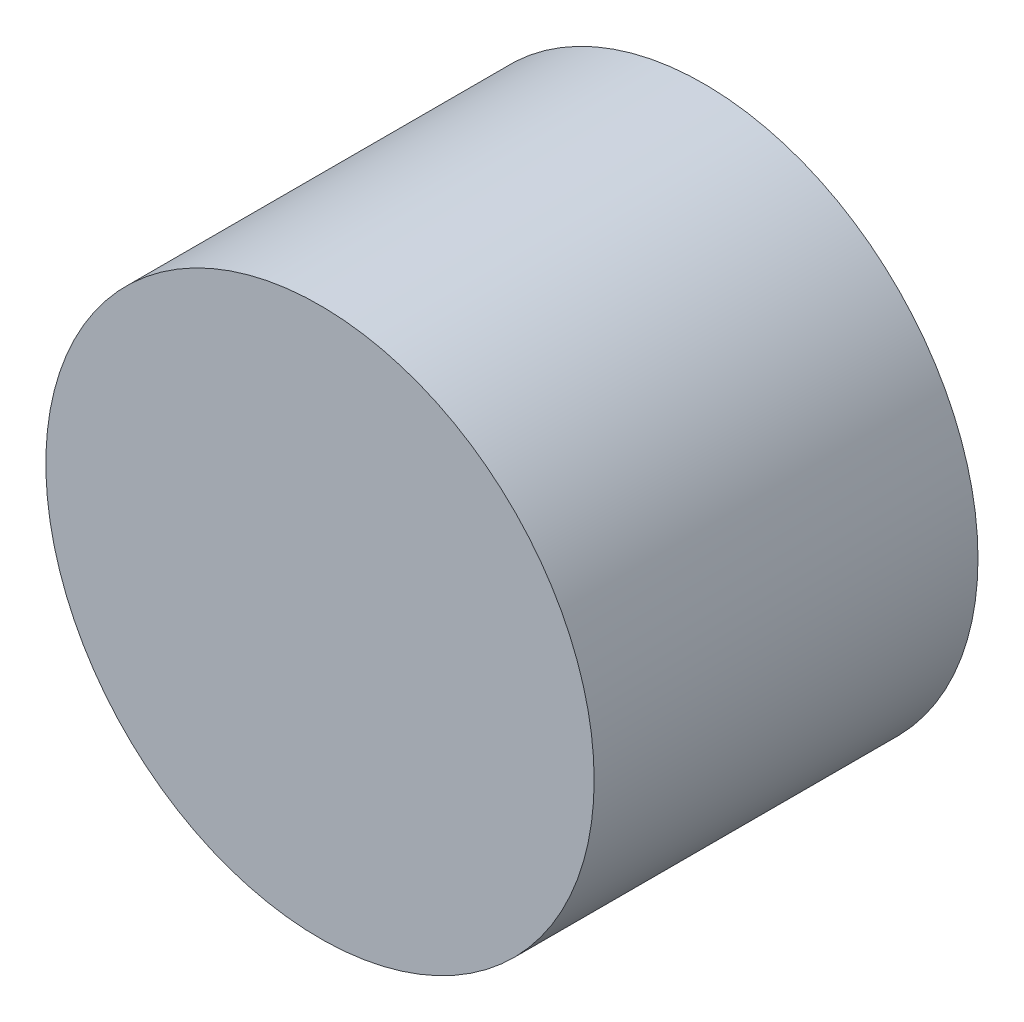
ISO-10303-21;
HEADER;
FILE_DESCRIPTION(('STEP AP214'),'2;1');
FILE_NAME('part.step','',(''),(''),'','','');
FILE_SCHEMA(('AUTOMOTIVE_DESIGN { 1 0 10303 214 1 1 1 1 }'));
ENDSEC;
DATA;
#1=APPLICATION_CONTEXT('core data for automotive mechanical design processes');
#2=APPLICATION_PROTOCOL_DEFINITION('international standard','automotive_design',2000,#1);
#3=PRODUCT_CONTEXT('',#1,'mechanical');
#4=PRODUCT('Part','Part','',(#3));
#5=PRODUCT_RELATED_PRODUCT_CATEGORY('part','',(#4));
#6=PRODUCT_DEFINITION_FORMATION('','',#4);
#7=PRODUCT_DEFINITION_CONTEXT('part definition',#1,'design');
#8=PRODUCT_DEFINITION('design','',#6,#7);
#9=PRODUCT_DEFINITION_SHAPE('','',#8);
#10=(LENGTH_UNIT() NAMED_UNIT(*) SI_UNIT(.MILLI.,.METRE.));
#11=(NAMED_UNIT(*) PLANE_ANGLE_UNIT() SI_UNIT($,.RADIAN.));
#12=(NAMED_UNIT(*) SI_UNIT($,.STERADIAN.) SOLID_ANGLE_UNIT());
#13=UNCERTAINTY_MEASURE_WITH_UNIT(LENGTH_MEASURE(1.E-05),#10,'distance_accuracy_value','');
#14=(GEOMETRIC_REPRESENTATION_CONTEXT(3) GLOBAL_UNCERTAINTY_ASSIGNED_CONTEXT((#13)) GLOBAL_UNIT_ASSIGNED_CONTEXT((#10,
#11,#12)) REPRESENTATION_CONTEXT('',''));
#15=CARTESIAN_POINT('',(0.,0.,0.));
#16=DIRECTION('',(0.,0.,1.));
#17=DIRECTION('',(1.,0.,0.));
#18=AXIS2_PLACEMENT_3D('',#15,#16,#17);
#19=CARTESIAN_POINT('',(0.,0.,44.45));
#20=DIRECTION('',(0.,0.,-1.));
#21=DIRECTION('',(-1.,0.,0.));
#22=AXIS2_PLACEMENT_3D('',#19,#20,#21);
#23=CYLINDRICAL_SURFACE('',#22,63.5);
#24=CARTESIAN_POINT('',(0.,0.,44.45));
#25=DIRECTION('',(0.,0.,1.));
#26=DIRECTION('',(1.,0.,0.));
#27=AXIS2_PLACEMENT_3D('',#24,#25,#26);
#28=CIRCLE('',#27,63.5);
#29=CARTESIAN_POINT('',(63.5,0.,44.45));
#30=VERTEX_POINT('',#29);
#31=EDGE_CURVE('E10',#30,#30,#28,.T.);
#32=ORIENTED_EDGE('',*,*,#31,.F.);
#33=EDGE_LOOP('',(#32));
#34=FACE_BOUND('',#33,.T.);
#35=CARTESIAN_POINT('',(0.,0.,-44.45));
#36=DIRECTION('',(0.,0.,1.));
#37=DIRECTION('',(1.,0.,0.));
#38=AXIS2_PLACEMENT_3D('',#35,#36,#37);
#39=CIRCLE('',#38,63.5);
#40=CARTESIAN_POINT('',(63.5,0.,-44.45));
#41=VERTEX_POINT('',#40);
#42=EDGE_CURVE('E40',#41,#41,#39,.T.);
#43=ORIENTED_EDGE('',*,*,#42,.T.);
#44=EDGE_LOOP('',(#43));
#45=FACE_BOUND('',#44,.T.);
#46=ADVANCED_FACE('F37',(#34,#45),#23,.T.);
#47=CARTESIAN_POINT('',(0.,0.,44.45));
#48=DIRECTION('',(0.,0.,1.));
#49=DIRECTION('',(1.,0.,0.));
#50=AXIS2_PLACEMENT_3D('',#47,#48,#49);
#51=PLANE('',#50);
#52=ORIENTED_EDGE('',*,*,#31,.T.);
#53=EDGE_LOOP('',(#52));
#54=FACE_BOUND('',#53,.T.);
#55=ADVANCED_FACE('F54',(#54),#51,.T.);
#56=CARTESIAN_POINT('',(0.,0.,-44.45));
#57=DIRECTION('',(0.,0.,1.));
#58=DIRECTION('',(1.,0.,0.));
#59=AXIS2_PLACEMENT_3D('',#56,#57,#58);
#60=PLANE('',#59);
#61=ORIENTED_EDGE('',*,*,#42,.F.);
#62=EDGE_LOOP('',(#61));
#63=FACE_BOUND('',#62,.T.);
#64=ADVANCED_FACE('F52',(#63),#60,.F.);
#65=CLOSED_SHELL('',(#46,#55,#64));
#66=MANIFOLD_SOLID_BREP('B2',#65);
#67=ADVANCED_BREP_SHAPE_REPRESENTATION('',(#18,#66),#14);
#68=SHAPE_DEFINITION_REPRESENTATION(#9,#67);
ENDSEC;
END-ISO-10303-21;
